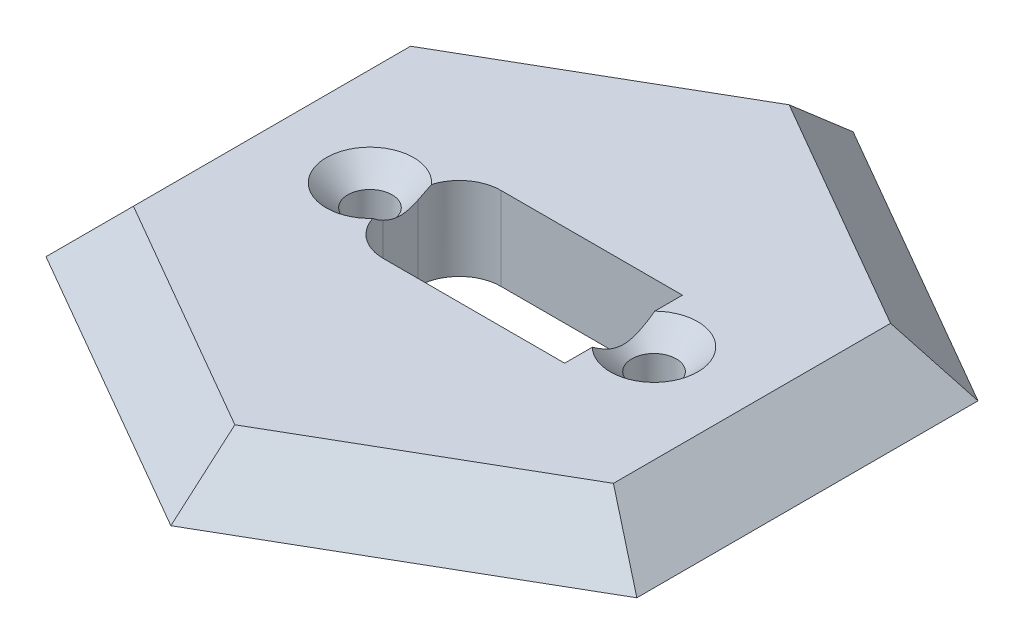
ISO-10303-21;
HEADER;
FILE_DESCRIPTION(('STEP AP214'),'2;1');
FILE_NAME('part.step','',(''),(''),'','','');
FILE_SCHEMA(('AUTOMOTIVE_DESIGN { 1 0 10303 214 1 1 1 1 }'));
ENDSEC;
DATA;
#1=APPLICATION_CONTEXT('core data for automotive mechanical design processes');
#2=APPLICATION_PROTOCOL_DEFINITION('international standard','automotive_design',2000,#1);
#3=PRODUCT_CONTEXT('',#1,'mechanical');
#4=PRODUCT('Part','Part','',(#3));
#5=PRODUCT_RELATED_PRODUCT_CATEGORY('part','',(#4));
#6=PRODUCT_DEFINITION_FORMATION('','',#4);
#7=PRODUCT_DEFINITION_CONTEXT('part definition',#1,'design');
#8=PRODUCT_DEFINITION('design','',#6,#7);
#9=PRODUCT_DEFINITION_SHAPE('','',#8);
#10=(LENGTH_UNIT() NAMED_UNIT(*) SI_UNIT(.MILLI.,.METRE.));
#11=(NAMED_UNIT(*) PLANE_ANGLE_UNIT() SI_UNIT($,.RADIAN.));
#12=(NAMED_UNIT(*) SI_UNIT($,.STERADIAN.) SOLID_ANGLE_UNIT());
#13=UNCERTAINTY_MEASURE_WITH_UNIT(LENGTH_MEASURE(1.E-05),#10,'distance_accuracy_value','');
#14=(GEOMETRIC_REPRESENTATION_CONTEXT(3) GLOBAL_UNCERTAINTY_ASSIGNED_CONTEXT((#13)) GLOBAL_UNIT_ASSIGNED_CONTEXT((#10,
#11,#12)) REPRESENTATION_CONTEXT('',''));
#15=CARTESIAN_POINT('',(0.,0.,0.));
#16=DIRECTION('',(0.,0.,1.));
#17=DIRECTION('',(1.,0.,0.));
#18=AXIS2_PLACEMENT_3D('',#15,#16,#17);
#19=CARTESIAN_POINT('',(0.,4.,0.));
#20=DIRECTION('',(0.,1.,0.));
#21=DIRECTION('',(0.,0.,1.));
#22=AXIS2_PLACEMENT_3D('',#19,#20,#21);
#23=PLANE('',#22);
#24=CARTESIAN_POINT('',(-10.25,4.,0.));
#25=DIRECTION('',(0.,1.,0.));
#26=DIRECTION('',(0.,0.,1.));
#27=AXIS2_PLACEMENT_3D('',#24,#25,#26);
#28=CIRCLE('',#27,3.15);
#29=CARTESIAN_POINT('',(-7.92085301054714,4.,-2.12074852387611));
#30=VERTEX_POINT('',#29);
#31=CARTESIAN_POINT('',(-7.92085301054721,4.,2.12074852387586));
#32=VERTEX_POINT('',#31);
#33=EDGE_CURVE('E70',#30,#32,#28,.T.);
#34=ORIENTED_EDGE('',*,*,#33,.F.);
#35=CARTESIAN_POINT('',(-5.05,4.,-1.25));
#36=DIRECTION('',(0.,1.,0.));
#37=DIRECTION('',(0.,0.,-1.));
#38=AXIS2_PLACEMENT_3D('',#35,#36,#37);
#39=CIRCLE('',#38,3.);
#40=CARTESIAN_POINT('',(-5.04999999999998,4.,-4.25));
#41=VERTEX_POINT('',#40);
#42=EDGE_CURVE('E168',#41,#30,#39,.T.);
#43=ORIENTED_EDGE('',*,*,#42,.F.);
#44=DIRECTION('',(-1.,0.,0.));
#45=VECTOR('',#44,1.);
#46=CARTESIAN_POINT('',(-5.04999999999998,4.,-4.25));
#47=LINE('',#46,#45);
#48=CARTESIAN_POINT('',(8.05,4.,-4.25));
#49=VERTEX_POINT('',#48);
#50=EDGE_CURVE('E179',#49,#41,#47,.T.);
#51=ORIENTED_EDGE('',*,*,#50,.F.);
#52=DIRECTION('',(0.,0.,-1.));
#53=VECTOR('',#52,1.);
#54=CARTESIAN_POINT('',(8.05,4.,4.25));
#55=LINE('',#54,#53);
#56=CARTESIAN_POINT('',(8.05,4.,-2.2544400635191));
#57=VERTEX_POINT('',#56);
#58=EDGE_CURVE('E248',#57,#49,#55,.T.);
#59=ORIENTED_EDGE('',*,*,#58,.F.);
#60=CARTESIAN_POINT('',(10.25,4.,0.));
#61=DIRECTION('',(0.,1.,0.));
#62=DIRECTION('',(0.,0.,1.));
#63=AXIS2_PLACEMENT_3D('',#60,#61,#62);
#64=CIRCLE('',#63,3.15);
#65=CARTESIAN_POINT('',(8.05,4.,2.2544400635191));
#66=VERTEX_POINT('',#65);
#67=EDGE_CURVE('E76',#66,#57,#64,.T.);
#68=ORIENTED_EDGE('',*,*,#67,.F.);
#69=CARTESIAN_POINT('',(8.05,4.,4.25));
#70=VERTEX_POINT('',#69);
#71=EDGE_CURVE('E185',#70,#66,#55,.T.);
#72=ORIENTED_EDGE('',*,*,#71,.F.);
#73=DIRECTION('',(1.,0.,0.));
#74=VECTOR('',#73,1.);
#75=CARTESIAN_POINT('',(-5.04999999999998,4.,4.25));
#76=LINE('',#75,#74);
#77=CARTESIAN_POINT('',(-5.04999999999998,4.,4.25));
#78=VERTEX_POINT('',#77);
#79=EDGE_CURVE('E183',#78,#70,#76,.T.);
#80=ORIENTED_EDGE('',*,*,#79,.F.);
#81=CARTESIAN_POINT('',(-5.05,4.,1.25));
#82=DIRECTION('',(0.,1.,0.));
#83=DIRECTION('',(0.,0.,-1.));
#84=AXIS2_PLACEMENT_3D('',#81,#82,#83);
#85=CIRCLE('',#84,3.);
#86=EDGE_CURVE('E170',#32,#78,#85,.T.);
#87=ORIENTED_EDGE('',*,*,#86,.F.);
#88=EDGE_LOOP('',(#34,#43,#51,#59,#68,#72,#80,#87));
#89=FACE_BOUND('',#88,.T.);
#90=DIRECTION('',(0.,0.,-1.));
#91=VECTOR('',#90,1.);
#92=CARTESIAN_POINT('',(17.3205080756888,4.,10.));
#93=LINE('',#92,#91);
#94=CARTESIAN_POINT('',(17.3205080756888,4.,10.));
#95=VERTEX_POINT('',#94);
#96=CARTESIAN_POINT('',(17.3205080756888,4.,-10.));
#97=VERTEX_POINT('',#96);
#98=EDGE_CURVE('E382',#95,#97,#93,.T.);
#99=ORIENTED_EDGE('',*,*,#98,.T.);
#100=DIRECTION('',(-0.866025403784439,0.,-0.5));
#101=VECTOR('',#100,1.);
#102=CARTESIAN_POINT('',(17.3205080756888,4.,-10.));
#103=LINE('',#102,#101);
#104=CARTESIAN_POINT('',(0.,4.,-20.));
#105=VERTEX_POINT('',#104);
#106=EDGE_CURVE('E314',#97,#105,#103,.T.);
#107=ORIENTED_EDGE('',*,*,#106,.T.);
#108=DIRECTION('',(-0.866025403784439,0.,0.5));
#109=VECTOR('',#108,1.);
#110=CARTESIAN_POINT('',(0.,4.,-20.));
#111=LINE('',#110,#109);
#112=CARTESIAN_POINT('',(-17.3205080756888,4.,-10.));
#113=VERTEX_POINT('',#112);
#114=EDGE_CURVE('E367',#105,#113,#111,.T.);
#115=ORIENTED_EDGE('',*,*,#114,.T.);
#116=DIRECTION('',(0.,0.,1.));
#117=VECTOR('',#116,1.);
#118=CARTESIAN_POINT('',(-17.3205080756888,4.,-10.));
#119=LINE('',#118,#117);
#120=CARTESIAN_POINT('',(-17.3205080756888,4.,9.99999999999999));
#121=VERTEX_POINT('',#120);
#122=EDGE_CURVE('E371',#113,#121,#119,.T.);
#123=ORIENTED_EDGE('',*,*,#122,.T.);
#124=DIRECTION('',(0.866025403784439,0.,0.5));
#125=VECTOR('',#124,1.);
#126=CARTESIAN_POINT('',(-17.3205080756888,4.,9.99999999999999));
#127=LINE('',#126,#125);
#128=CARTESIAN_POINT('',(0.,4.,20.));
#129=VERTEX_POINT('',#128);
#130=EDGE_CURVE('E375',#121,#129,#127,.T.);
#131=ORIENTED_EDGE('',*,*,#130,.T.);
#132=DIRECTION('',(0.866025403784439,0.,-0.5));
#133=VECTOR('',#132,1.);
#134=CARTESIAN_POINT('',(0.,4.,20.));
#135=LINE('',#134,#133);
#136=EDGE_CURVE('E379',#129,#95,#135,.T.);
#137=ORIENTED_EDGE('',*,*,#136,.T.);
#138=EDGE_LOOP('',(#99,#107,#115,#123,#131,#137));
#139=FACE_BOUND('',#138,.T.);
#140=ADVANCED_FACE('F48',(#89,#139),#23,.T.);
#141=CARTESIAN_POINT('',(0.,0.,0.));
#142=DIRECTION('',(0.,1.,0.));
#143=DIRECTION('',(0.,0.,1.));
#144=AXIS2_PLACEMENT_3D('',#141,#142,#143);
#145=PLANE('',#144);
#146=CARTESIAN_POINT('',(0.,0.,0.));
#147=DIRECTION('',(0.,-1.,0.));
#148=DIRECTION('',(0.,0.,-1.));
#149=AXIS2_PLACEMENT_3D('',#146,#147,#148);
#150=CIRCLE('',#149,17.);
#151=CARTESIAN_POINT('',(0.,0.,-17.));
#152=VERTEX_POINT('',#151);
#153=EDGE_CURVE('E216',#152,#152,#150,.T.);
#154=ORIENTED_EDGE('',*,*,#153,.F.);
#155=EDGE_LOOP('',(#154));
#156=FACE_BOUND('',#155,.T.);
#157=DIRECTION('',(0.866025403784439,0.,0.5));
#158=VECTOR('',#157,1.);
#159=CARTESIAN_POINT('',(10.6602540378444,0.,-18.4641016151378));
#160=LINE('',#159,#158);
#161=CARTESIAN_POINT('',(21.3205080756888,0.,-12.3094010767585));
#162=VERTEX_POINT('',#161);
#163=CARTESIAN_POINT('',(0.,0.,-24.618802153517));
#164=VERTEX_POINT('',#163);
#165=EDGE_CURVE('E263',#162,#164,#160,.F.);
#166=ORIENTED_EDGE('',*,*,#165,.F.);
#167=DIRECTION('',(0.,0.,1.));
#168=VECTOR('',#167,1.);
#169=CARTESIAN_POINT('',(21.3205080756888,0.,0.));
#170=LINE('',#169,#168);
#171=CARTESIAN_POINT('',(21.3205080756888,0.,12.3094010767585));
#172=VERTEX_POINT('',#171);
#173=EDGE_CURVE('E260',#172,#162,#170,.F.);
#174=ORIENTED_EDGE('',*,*,#173,.F.);
#175=DIRECTION('',(-0.866025403784439,0.,0.5));
#176=VECTOR('',#175,1.);
#177=CARTESIAN_POINT('',(10.6602540378444,0.,18.4641016151378));
#178=LINE('',#177,#176);
#179=CARTESIAN_POINT('',(0.,0.,24.618802153517));
#180=VERTEX_POINT('',#179);
#181=EDGE_CURVE('E257',#180,#172,#178,.F.);
#182=ORIENTED_EDGE('',*,*,#181,.F.);
#183=DIRECTION('',(-0.866025403784439,0.,-0.5));
#184=VECTOR('',#183,1.);
#185=CARTESIAN_POINT('',(-10.6602540378444,0.,18.4641016151378));
#186=LINE('',#185,#184);
#187=CARTESIAN_POINT('',(-21.3205080756888,0.,12.3094010767585));
#188=VERTEX_POINT('',#187);
#189=EDGE_CURVE('E254',#188,#180,#186,.F.);
#190=ORIENTED_EDGE('',*,*,#189,.F.);
#191=DIRECTION('',(0.,0.,-1.));
#192=VECTOR('',#191,1.);
#193=CARTESIAN_POINT('',(-21.3205080756888,0.,0.));
#194=LINE('',#193,#192);
#195=CARTESIAN_POINT('',(-21.3205080756888,0.,-12.3094010767585));
#196=VERTEX_POINT('',#195);
#197=EDGE_CURVE('E251',#196,#188,#194,.F.);
#198=ORIENTED_EDGE('',*,*,#197,.F.);
#199=DIRECTION('',(0.866025403784439,0.,-0.5));
#200=VECTOR('',#199,1.);
#201=CARTESIAN_POINT('',(-10.6602540378444,0.,-18.4641016151378));
#202=LINE('',#201,#200);
#203=EDGE_CURVE('E238',#164,#196,#202,.F.);
#204=ORIENTED_EDGE('',*,*,#203,.F.);
#205=EDGE_LOOP('',(#166,#174,#182,#190,#198,#204));
#206=FACE_BOUND('',#205,.T.);
#207=ADVANCED_FACE('F50',(#156,#206),#145,.F.);
#208=CARTESIAN_POINT('',(0.,-2.,0.));
#209=DIRECTION('',(0.,1.,0.));
#210=DIRECTION('',(0.,0.,1.));
#211=AXIS2_PLACEMENT_3D('',#208,#209,#210);
#212=CYLINDRICAL_SURFACE('',#211,17.);
#213=CARTESIAN_POINT('',(0.,-2.,0.));
#214=DIRECTION('',(0.,-1.,0.));
#215=DIRECTION('',(0.,0.,-1.));
#216=AXIS2_PLACEMENT_3D('',#213,#214,#215);
#217=CIRCLE('',#216,17.);
#218=CARTESIAN_POINT('',(0.,-2.,-17.));
#219=VERTEX_POINT('',#218);
#220=EDGE_CURVE('E196',#219,#219,#217,.T.);
#221=ORIENTED_EDGE('',*,*,#220,.F.);
#222=EDGE_LOOP('',(#221));
#223=FACE_BOUND('',#222,.T.);
#224=ORIENTED_EDGE('',*,*,#153,.T.);
#225=EDGE_LOOP('',(#224));
#226=FACE_BOUND('',#225,.T.);
#227=ADVANCED_FACE('F288',(#223,#226),#212,.T.);
#228=CARTESIAN_POINT('',(0.,-2.,0.));
#229=DIRECTION('',(0.,-1.,0.));
#230=DIRECTION('',(0.,0.,-1.));
#231=AXIS2_PLACEMENT_3D('',#228,#229,#230);
#232=PLANE('',#231);
#233=CARTESIAN_POINT('',(-10.25,-2.,0.));
#234=DIRECTION('',(0.,-1.,0.));
#235=DIRECTION('',(0.,0.,-1.));
#236=AXIS2_PLACEMENT_3D('',#233,#234,#235);
#237=CIRCLE('',#236,1.6);
#238=CARTESIAN_POINT('',(-10.25,-2.,-1.6));
#239=VERTEX_POINT('',#238);
#240=EDGE_CURVE('E243',#239,#239,#237,.T.);
#241=ORIENTED_EDGE('',*,*,#240,.F.);
#242=EDGE_LOOP('',(#241));
#243=FACE_BOUND('',#242,.T.);
#244=CARTESIAN_POINT('',(10.25,-2.,0.));
#245=DIRECTION('',(0.,-1.,0.));
#246=DIRECTION('',(0.,0.,-1.));
#247=AXIS2_PLACEMENT_3D('',#244,#245,#246);
#248=CIRCLE('',#247,1.6);
#249=CARTESIAN_POINT('',(10.25,-2.,-1.6));
#250=VERTEX_POINT('',#249);
#251=EDGE_CURVE('E239',#250,#250,#248,.T.);
#252=ORIENTED_EDGE('',*,*,#251,.F.);
#253=EDGE_LOOP('',(#252));
#254=FACE_BOUND('',#253,.T.);
#255=DIRECTION('',(0.,0.,1.));
#256=VECTOR('',#255,1.);
#257=CARTESIAN_POINT('',(8.05,-2.,0.));
#258=LINE('',#257,#256);
#259=CARTESIAN_POINT('',(8.05,-2.,-4.25));
#260=VERTEX_POINT('',#259);
#261=CARTESIAN_POINT('',(8.05,-2.,4.25));
#262=VERTEX_POINT('',#261);
#263=EDGE_CURVE('E235',#260,#262,#258,.T.);
#264=ORIENTED_EDGE('',*,*,#263,.F.);
#265=DIRECTION('',(1.,0.,0.));
#266=VECTOR('',#265,1.);
#267=CARTESIAN_POINT('',(0.,-2.,-4.25));
#268=LINE('',#267,#266);
#269=CARTESIAN_POINT('',(-5.04999999999998,-2.,-4.25));
#270=VERTEX_POINT('',#269);
#271=EDGE_CURVE('E220',#270,#260,#268,.T.);
#272=ORIENTED_EDGE('',*,*,#271,.F.);
#273=CARTESIAN_POINT('',(-5.05,-2.,-1.25));
#274=DIRECTION('',(0.,-1.,0.));
#275=DIRECTION('',(0.,0.,-1.));
#276=AXIS2_PLACEMENT_3D('',#273,#274,#275);
#277=CIRCLE('',#276,3.);
#278=CARTESIAN_POINT('',(-8.05,-2.,-1.24999999999998));
#279=VERTEX_POINT('',#278);
#280=EDGE_CURVE('E223',#279,#270,#277,.T.);
#281=ORIENTED_EDGE('',*,*,#280,.F.);
#282=DIRECTION('',(0.,0.,-1.));
#283=VECTOR('',#282,1.);
#284=CARTESIAN_POINT('',(-8.05,-2.,0.));
#285=LINE('',#284,#283);
#286=CARTESIAN_POINT('',(-8.05,-2.,1.24999999999998));
#287=VERTEX_POINT('',#286);
#288=EDGE_CURVE('E226',#287,#279,#285,.T.);
#289=ORIENTED_EDGE('',*,*,#288,.F.);
#290=CARTESIAN_POINT('',(-5.05,-2.,1.25));
#291=DIRECTION('',(0.,-1.,0.));
#292=DIRECTION('',(0.,0.,-1.));
#293=AXIS2_PLACEMENT_3D('',#290,#291,#292);
#294=CIRCLE('',#293,3.);
#295=CARTESIAN_POINT('',(-5.04999999999998,-2.,4.25));
#296=VERTEX_POINT('',#295);
#297=EDGE_CURVE('E229',#296,#287,#294,.T.);
#298=ORIENTED_EDGE('',*,*,#297,.F.);
#299=DIRECTION('',(-1.,0.,0.));
#300=VECTOR('',#299,1.);
#301=CARTESIAN_POINT('',(0.,-2.,4.25));
#302=LINE('',#301,#300);
#303=EDGE_CURVE('E232',#262,#296,#302,.T.);
#304=ORIENTED_EDGE('',*,*,#303,.F.);
#305=EDGE_LOOP('',(#264,#272,#281,#289,#298,#304));
#306=FACE_BOUND('',#305,.T.);
#307=ORIENTED_EDGE('',*,*,#220,.T.);
#308=EDGE_LOOP('',(#307));
#309=FACE_BOUND('',#308,.T.);
#310=ADVANCED_FACE('F282',(#243,#254,#306,#309),#232,.T.);
#311=CARTESIAN_POINT('',(8.05,-16.,4.25));
#312=DIRECTION('',(1.,0.,0.));
#313=DIRECTION('',(0.,0.,-1.));
#314=AXIS2_PLACEMENT_3D('',#311,#312,#313);
#315=PLANE('',#314);
#316=ORIENTED_EDGE('',*,*,#71,.T.);
#317=CARTESIAN_POINT('',(8.05,5.88776994401236,-4.53201125426609));
#318=CARTESIAN_POINT('',(8.05,5.79552288921214,-4.42945558697828));
#319=CARTESIAN_POINT('',(8.05,5.7035912538906,-4.32661378925197));
#320=CARTESIAN_POINT('',(8.05,5.52052544884391,-4.12020803771156));
#321=CARTESIAN_POINT('',(8.05,5.42939134573121,-4.01664402484963));
#322=CARTESIAN_POINT('',(8.05,5.24779769198032,-3.80831111917057));
#323=CARTESIAN_POINT('',(8.05,5.15734144093055,-3.70353934548399));
#324=CARTESIAN_POINT('',(8.05,4.977667481908,-3.49294420753631));
#325=CARTESIAN_POINT('',(8.05,4.88844972799008,-3.38712088253637));
#326=CARTESIAN_POINT('',(8.05,4.70654503975932,-3.16810255959324));
#327=CARTESIAN_POINT('',(8.05,4.61395000075133,-3.05483103536417));
#328=CARTESIAN_POINT('',(8.05,4.43107119404821,-2.82643892557324));
#329=CARTESIAN_POINT('',(8.05,4.3407873141612,-2.71131843021019));
#330=CARTESIAN_POINT('',(8.05,4.16346069699886,-2.47884447586285));
#331=CARTESIAN_POINT('',(8.05,4.07641372406316,-2.36149426212796));
#332=CARTESIAN_POINT('',(8.05,3.90666242735435,-2.12370873499496));
#333=CARTESIAN_POINT('',(8.05,3.82395693574178,-2.00327426435255));
#334=CARTESIAN_POINT('',(8.05,3.684110851468,-1.78805430944103));
#335=CARTESIAN_POINT('',(8.05,3.62563798539721,-1.69413938229576));
#336=CARTESIAN_POINT('',(8.05,3.51350091774603,-1.50339592287809));
#337=CARTESIAN_POINT('',(8.05,3.45983870161394,-1.40656620943964));
#338=CARTESIAN_POINT('',(8.05,3.35956324793287,-1.21035503809914));
#339=CARTESIAN_POINT('',(8.05,3.31289214812394,-1.1110035248744));
#340=CARTESIAN_POINT('',(8.05,3.22846193426358,-0.908577967255503));
#341=CARTESIAN_POINT('',(8.05,3.19069475417803,-0.805507390327418));
#342=CARTESIAN_POINT('',(8.05,3.13923314094333,-0.635915416750463));
#343=CARTESIAN_POINT('',(8.05,3.12185849586593,-0.570511687314567));
#344=CARTESIAN_POINT('',(8.05,3.09235773281676,-0.438521593061798));
#345=CARTESIAN_POINT('',(8.05,3.08023077099655,-0.371935420180614));
#346=CARTESIAN_POINT('',(8.05,3.0618680163744,-0.238180725747059));
#347=CARTESIAN_POINT('',(8.05,3.05561182152822,-0.171015045737476));
#348=CARTESIAN_POINT('',(8.05,3.04927368388518,-0.0363887051491592));
#349=CARTESIAN_POINT('',(8.05,3.04919164780455,0.0310719509574561));
#350=CARTESIAN_POINT('',(8.05,3.05520594092248,0.165697251868993));
#351=CARTESIAN_POINT('',(8.05,3.06130088003633,0.2328619598594));
#352=CARTESIAN_POINT('',(8.05,3.07932118025313,0.36640783283554));
#353=CARTESIAN_POINT('',(8.05,3.09124790919362,0.432788810255741));
#354=CARTESIAN_POINT('',(8.05,3.12039139975053,0.56465259400077));
#355=CARTESIAN_POINT('',(8.05,3.13762994183702,0.630130520665635));
#356=CARTESIAN_POINT('',(8.05,3.17665542817118,0.759700216233428));
#357=CARTESIAN_POINT('',(8.05,3.19844247913602,0.823791952574596));
#358=CARTESIAN_POINT('',(8.05,3.25128955009676,0.965101085266058));
#359=CARTESIAN_POINT('',(8.05,3.28332993896446,1.04194958331991));
#360=CARTESIAN_POINT('',(8.05,3.3520101657685,1.19357763697271));
#361=CARTESIAN_POINT('',(8.05,3.38865215426109,1.26835620511736));
#362=CARTESIAN_POINT('',(8.05,3.46562008410505,1.41614045481915));
#363=CARTESIAN_POINT('',(8.05,3.50595220820446,1.48914289158997));
#364=CARTESIAN_POINT('',(8.05,3.58949165241533,1.63348652183431));
#365=CARTESIAN_POINT('',(8.05,3.63269938434699,1.70482747538081));
#366=CARTESIAN_POINT('',(8.05,3.72202106739007,1.84705427350658));
#367=CARTESIAN_POINT('',(8.05,3.76816720492776,1.91791980984576));
#368=CARTESIAN_POINT('',(8.05,3.86234625857754,2.05838374263129));
#369=CARTESIAN_POINT('',(8.05,3.91037922816282,2.12798210308371));
#370=CARTESIAN_POINT('',(8.05,4.00791824871488,2.26601647590759));
#371=CARTESIAN_POINT('',(8.05,4.05742255227027,2.33445372650353));
#372=CARTESIAN_POINT('',(8.05,4.15768322731247,2.47039833393273));
#373=CARTESIAN_POINT('',(8.05,4.2084395518066,2.53790572551904));
#374=CARTESIAN_POINT('',(8.05,4.38109063880976,2.76390576343425));
#375=CARTESIAN_POINT('',(8.05,4.50535639768302,2.9205869321287));
#376=CARTESIAN_POINT('',(8.05,4.7577175404945,3.23084277102247));
#377=CARTESIAN_POINT('',(8.05,4.88581350373622,3.38441696535455));
#378=CARTESIAN_POINT('',(8.05,5.1447421119089,3.68934842952603));
#379=CARTESIAN_POINT('',(8.05,5.27557590285201,3.84070472401844));
#380=CARTESIAN_POINT('',(8.05,5.53919226790598,4.14171338125875));
#381=CARTESIAN_POINT('',(8.05,5.67197490073151,4.29136569242685));
#382=CARTESIAN_POINT('',(8.05,5.93927247155715,4.58967166168537));
#383=CARTESIAN_POINT('',(8.05,6.07379042419925,4.73832261442289));
#384=CARTESIAN_POINT('',(8.05,6.34395178402922,5.03459905936306));
#385=CARTESIAN_POINT('',(8.05,6.47959520057597,5.18222454301955));
#386=CARTESIAN_POINT('',(8.05,6.88775928063837,5.62381124079156));
#387=CARTESIAN_POINT('',(8.05,7.16158697719268,5.916563805233));
#388=CARTESIAN_POINT('',(8.05,7.67886598919352,6.46534491595376));
#389=CARTESIAN_POINT('',(8.05,7.9220671904053,6.72161004061001));
#390=CARTESIAN_POINT('',(8.05,8.40974815976266,7.23295983620239));
#391=CARTESIAN_POINT('',(8.05,8.65422802910063,7.48804441060532));
#392=CARTESIAN_POINT('',(8.05,9.14322866544042,7.9964030132443));
#393=CARTESIAN_POINT('',(8.05,9.38774609712871,8.24968025323676));
#394=CARTESIAN_POINT('',(8.05,9.87747173321314,8.75552122912428));
#395=CARTESIAN_POINT('',(8.05,10.1226798722246,9.00808502830404));
#396=CARTESIAN_POINT('',(8.05,10.3681418542701,9.26040087458473));
#397=B_SPLINE_CURVE_WITH_KNOTS('',3,(#317,#318,#319,#320,#321,#322,#323,#324,#325,#326,#327,
#328,#329,#330,#331,#332,#333,#334,#335,#336,#337,#338,#339,#340,#341,#342,#343,#344,#345,#346,
#347,#348,#349,#350,#351,#352,#353,#354,#355,#356,#357,#358,#359,#360,#361,#362,#363,#364,#365,
#366,#367,#368,#369,#370,#371,#372,#373,#374,#375,#376,#377,#378,#379,#380,#381,#382,#383,#384,
#385,#386,#387,#388,#389,#390,#391,#392,#393,#394,#395,#396),.UNSPECIFIED.,.F.,.F.,(4,2,2,2,2,2,
2,2,2,2,2,2,2,2,2,2,2,2,2,2,2,2,2,2,2,2,2,2,2,2,2,2,2,2,2,2,2,2,2,4),(0.,0.413819199168992,
0.827672638136937,1.24291798283643,1.65814788158306,2.09703163388058,2.53589404064617,
2.97416037162922,3.41230820032737,3.74409646098779,4.07602103264668,4.4050253830496,
4.73373053422526,4.93656732751132,5.13937149169901,5.34146823357136,5.54356192201519,
5.74561014079606,5.94770577243133,6.15064135621035,6.35358170180185,6.60316539244486,
6.85286616308926,7.10299324379599,7.35315622298819,7.60681677800365,7.86048452700389,
8.1138621852535,8.36723034779093,8.96705564571565,9.56697212840348,10.1671449591739,
10.7673359092095,11.3687681029784,11.9702053030288,13.1727519660781,14.2326382208286,
15.292609662823,16.3487536767008,17.4048008640878),.UNSPECIFIED.);
#398=EDGE_CURVE('E63',#66,#57,#397,.F.);
#399=ORIENTED_EDGE('',*,*,#398,.T.);
#400=ORIENTED_EDGE('',*,*,#58,.T.);
#401=DIRECTION('',(0.,1.,0.));
#402=VECTOR('',#401,1.);
#403=CARTESIAN_POINT('',(8.05,-16.,-4.25));
#404=LINE('',#403,#402);
#405=EDGE_CURVE('E192',#260,#49,#404,.T.);
#406=ORIENTED_EDGE('',*,*,#405,.F.);
#407=ORIENTED_EDGE('',*,*,#263,.T.);
#408=DIRECTION('',(0.,1.,0.));
#409=VECTOR('',#408,1.);
#410=CARTESIAN_POINT('',(8.05,-16.,4.25));
#411=LINE('',#410,#409);
#412=EDGE_CURVE('E193',#262,#70,#411,.T.);
#413=ORIENTED_EDGE('',*,*,#412,.T.);
#414=EDGE_LOOP('',(#316,#399,#400,#406,#407,#413));
#415=FACE_BOUND('',#414,.T.);
#416=ADVANCED_FACE('F276',(#415),#315,.F.);
#417=CARTESIAN_POINT('',(-5.04999999999998,-16.,4.25));
#418=DIRECTION('',(0.,0.,1.));
#419=DIRECTION('',(1.,0.,0.));
#420=AXIS2_PLACEMENT_3D('',#417,#418,#419);
#421=PLANE('',#420);
#422=ORIENTED_EDGE('',*,*,#303,.T.);
#423=DIRECTION('',(0.,1.,0.));
#424=VECTOR('',#423,1.);
#425=CARTESIAN_POINT('',(-5.04999999999998,-16.,4.25));
#426=LINE('',#425,#424);
#427=EDGE_CURVE('E197',#296,#78,#426,.T.);
#428=ORIENTED_EDGE('',*,*,#427,.T.);
#429=ORIENTED_EDGE('',*,*,#79,.T.);
#430=ORIENTED_EDGE('',*,*,#412,.F.);
#431=EDGE_LOOP('',(#422,#428,#429,#430));
#432=FACE_BOUND('',#431,.T.);
#433=ADVANCED_FACE('F281',(#432),#421,.F.);
#434=CARTESIAN_POINT('',(-5.05,-16.,1.25));
#435=DIRECTION('',(0.,1.,0.));
#436=DIRECTION('',(0.,0.,1.));
#437=AXIS2_PLACEMENT_3D('',#434,#435,#436);
#438=CYLINDRICAL_SURFACE('',#437,3.);
#439=DIRECTION('',(0.,1.,0.));
#440=VECTOR('',#439,1.);
#441=CARTESIAN_POINT('',(-8.05,-16.,1.24999999999998));
#442=LINE('',#441,#440);
#443=CARTESIAN_POINT('',(-8.05,3.380316185776,1.24999999999998));
#444=VERTEX_POINT('',#443);
#445=EDGE_CURVE('E201',#287,#444,#442,.T.);
#446=ORIENTED_EDGE('',*,*,#445,.T.);
#447=CARTESIAN_POINT('',(-8.04998760093809,3.37607718202849,1.24137479172843));
#448=CARTESIAN_POINT('',(-8.04999567772728,3.37745161358634,1.24418589152961));
#449=CARTESIAN_POINT('',(-8.04999980141325,3.37883170738633,1.24699429422211));
#450=CARTESIAN_POINT('',(-8.05000475054784,3.41456511140938,1.31934636616054));
#451=CARTESIAN_POINT('',(-8.04759375612452,3.45235018202452,1.38723569674285));
#452=CARTESIAN_POINT('',(-8.03858311246755,3.53279424863439,1.51981040458883));
#453=CARTESIAN_POINT('',(-8.0319768792092,3.57546081922704,1.58449057304288));
#454=CARTESIAN_POINT('',(-8.01504335373948,3.6643846718136,1.71109120403412));
#455=CARTESIAN_POINT('',(-8.00470515789291,3.7106521605924,1.7730029762068));
#456=CARTESIAN_POINT('',(-7.98068346023095,3.80566838519096,1.89413061398324));
#457=CARTESIAN_POINT('',(-7.96700211104617,3.85441550846356,1.95334818537338));
#458=CARTESIAN_POINT('',(-7.94206696052587,3.93576749448442,2.04838068502665));
#459=CARTESIAN_POINT('',(-7.93172700552225,3.96782845232808,2.0849078877546));
#460=CARTESIAN_POINT('',(-7.91251531939726,4.02466773059707,2.14822957847244));
#461=CARTESIAN_POINT('',(-7.90390151168934,4.04931289962244,2.17522287458028));
#462=CARTESIAN_POINT('',(-7.85915413886983,4.17332931563397,2.30896119680817));
#463=CARTESIAN_POINT('',(-7.81800626974395,4.27500961818055,2.41195132781633));
#464=CARTESIAN_POINT('',(-7.72592309491027,4.48115013891006,2.61067291310477));
#465=CARTESIAN_POINT('',(-7.67497560343856,4.58561367722245,2.7063951208841));
#466=CARTESIAN_POINT('',(-7.56389652292641,4.79598325336077,2.89069920571134));
#467=CARTESIAN_POINT('',(-7.50376429158811,4.901889391597,2.97928058273157));
#468=CARTESIAN_POINT('',(-7.40711653414247,5.06102268793247,3.10656412553554));
#469=CARTESIAN_POINT('',(-7.3738612003548,5.11406105629082,3.14802291713335));
#470=CARTESIAN_POINT('',(-7.30523502367783,5.22018942441799,3.22907364758905));
#471=CARTESIAN_POINT('',(-7.26986430500911,5.27327942097532,3.26866569582298));
#472=CARTESIAN_POINT('',(-7.23345730429755,5.32636156003217,3.30730751233505));
#473=B_SPLINE_CURVE_WITH_KNOTS('',3,(#447,#448,#449,#450,#451,#452,#453,#454,#455,#456,#457,
#458,#459,#460,#461,#462,#463,#464,#465,#466,#467,#468,#469,#470,#471,#472),.UNSPECIFIED.,.F.,
.F.,(4,2,2,2,2,2,2,2,2,2,2,2,4),(0.,0.00938752666886937,0.242080623787515,0.475139815951356,
0.708885520141946,0.942481112046757,1.09152259958736,1.20417420963375,1.65487712111016,
2.10614414475423,2.55744274040381,2.78265414970397,3.00785234699921),.UNSPECIFIED.);
#474=EDGE_CURVE('E12',#444,#32,#473,.T.);
#475=ORIENTED_EDGE('',*,*,#474,.T.);
#476=ORIENTED_EDGE('',*,*,#86,.T.);
#477=ORIENTED_EDGE('',*,*,#427,.F.);
#478=ORIENTED_EDGE('',*,*,#297,.T.);
#479=EDGE_LOOP('',(#446,#475,#476,#477,#478));
#480=FACE_BOUND('',#479,.T.);
#481=ADVANCED_FACE('F419',(#480),#438,.F.);
#482=CARTESIAN_POINT('',(-8.05,-16.,1.24999999999998));
#483=DIRECTION('',(-1.,0.,0.));
#484=DIRECTION('',(0.,0.,1.));
#485=AXIS2_PLACEMENT_3D('',#482,#483,#484);
#486=PLANE('',#485);
#487=DIRECTION('',(0.,1.,0.));
#488=VECTOR('',#487,1.);
#489=CARTESIAN_POINT('',(-8.05,-16.,-1.24999999999998));
#490=LINE('',#489,#488);
#491=CARTESIAN_POINT('',(-8.05,3.380316185776,-1.24999999999998));
#492=VERTEX_POINT('',#491);
#493=EDGE_CURVE('E205',#279,#492,#490,.T.);
#494=ORIENTED_EDGE('',*,*,#493,.T.);
#495=CARTESIAN_POINT('',(-8.05,4.04271554082538,-2.31374858716929));
#496=CARTESIAN_POINT('',(-8.05,4.00124865199346,-2.2565164769936));
#497=CARTESIAN_POINT('',(-8.05,3.96024685701552,-2.19894221273686));
#498=CARTESIAN_POINT('',(-8.05,3.87937022698615,-2.08298468402822));
#499=CARTESIAN_POINT('',(-8.05,3.83949570778256,-2.02460119954002));
#500=CARTESIAN_POINT('',(-8.05,3.76079589327907,-1.90648530150564));
#501=CARTESIAN_POINT('',(-8.05,3.72198086774058,-1.84674601041902));
#502=CARTESIAN_POINT('',(-8.05,3.64601220942833,-1.72622831422233));
#503=CARTESIAN_POINT('',(-8.05,3.60885845340811,-1.66544998666043));
#504=CARTESIAN_POINT('',(-8.05,3.49706072252303,-1.47572294552068));
#505=CARTESIAN_POINT('',(-8.05,3.42575399202773,-1.34476679392823));
#506=CARTESIAN_POINT('',(-8.05,3.29652736146864,-1.0766605669708));
#507=CARTESIAN_POINT('',(-8.05,3.23856376644298,-0.939532518935735));
#508=CARTESIAN_POINT('',(-8.05,3.16740702927521,-0.731052069509704));
#509=CARTESIAN_POINT('',(-8.05,3.14655514106996,-0.662319121160674));
#510=CARTESIAN_POINT('',(-8.05,3.11040374468697,-0.523376576891461));
#511=CARTESIAN_POINT('',(-8.05,3.09510466043713,-0.453166868661011));
#512=CARTESIAN_POINT('',(-8.05,3.07106256870315,-0.312764651579374));
#513=CARTESIAN_POINT('',(-8.05,3.06221936736127,-0.242589553338242));
#514=CARTESIAN_POINT('',(-8.05,3.05123112943656,-0.101714510847381));
#515=CARTESIAN_POINT('',(-8.05,3.04908529696909,-0.0310146299614014));
#516=CARTESIAN_POINT('',(-8.05,3.05159618903967,0.108478181380193));
#517=CARTESIAN_POINT('',(-8.05,3.05608290936891,0.177274283965098));
#518=CARTESIAN_POINT('',(-8.05,3.07127814062294,0.314178530256199));
#519=CARTESIAN_POINT('',(-8.05,3.0819879626484,0.382286525912806));
#520=CARTESIAN_POINT('',(-8.05,3.10926409169231,0.518461140538603));
#521=CARTESIAN_POINT('',(-8.05,3.12592313750604,0.586508938666373));
#522=CARTESIAN_POINT('',(-8.05,3.16427642537308,0.721134755583956));
#523=CARTESIAN_POINT('',(-8.05,3.18597002527901,0.787712960632458));
#524=CARTESIAN_POINT('',(-8.05,3.26560257578578,1.00793272992656));
#525=CARTESIAN_POINT('',(-8.05,3.33302953891531,1.15815913447272));
#526=CARTESIAN_POINT('',(-8.05,3.44511586331957,1.37789117279159));
#527=CARTESIAN_POINT('',(-8.05,3.48439409978072,1.45034329461979));
#528=CARTESIAN_POINT('',(-8.05,3.56588479631359,1.5935825034566));
#529=CARTESIAN_POINT('',(-8.05,3.60809669532049,1.66436990539691));
#530=CARTESIAN_POINT('',(-8.05,3.69262996510189,1.80090747594466));
#531=CARTESIAN_POINT('',(-8.05,3.73483551228303,1.8667302036948));
#532=CARTESIAN_POINT('',(-8.05,3.82096055117059,1.99725058523734));
#533=CARTESIAN_POINT('',(-8.05,3.86488017187027,2.06194815382376));
#534=CARTESIAN_POINT('',(-8.05,3.95374802137904,2.18982924490053));
#535=CARTESIAN_POINT('',(-8.05,3.99868459675615,2.25302089938225));
#536=CARTESIAN_POINT('',(-8.05,4.08970007346421,2.37855104860999));
#537=CARTESIAN_POINT('',(-8.05,4.1357786628417,2.4408897692777));
#538=CARTESIAN_POINT('',(-8.05,4.18232268506602,2.50287324437448));
#539=B_SPLINE_CURVE_WITH_KNOTS('',3,(#495,#496,#497,#498,#499,#500,#501,#502,#503,#504,#505,
#506,#507,#508,#509,#510,#511,#512,#513,#514,#515,#516,#517,#518,#519,#520,#521,#522,#523,#524,
#525,#526,#527,#528,#529,#530,#531,#532,#533,#534,#535,#536,#537,#538),.UNSPECIFIED.,.F.,.F.,(4,
2,2,2,2,2,2,2,2,2,2,2,2,2,2,2,2,2,2,2,2,4),(0.,0.212029895478164,0.424118621703257,
0.637818262161033,0.851502022248558,1.29839154326874,1.74379612250843,1.95908693234786,
2.17439417507254,2.38628441739433,2.59814947869171,2.80467736141511,3.01124877180154,
3.22119193175516,3.43110832857794,3.92353037676244,4.17075693186514,4.41793633416059,
4.65248456428478,4.88705047959129,5.11965745421895,5.35220157520174),.UNSPECIFIED.);
#540=EDGE_CURVE('E156',#492,#444,#539,.T.);
#541=ORIENTED_EDGE('',*,*,#540,.T.);
#542=ORIENTED_EDGE('',*,*,#445,.F.);
#543=ORIENTED_EDGE('',*,*,#288,.T.);
#544=EDGE_LOOP('',(#494,#541,#542,#543));
#545=FACE_BOUND('',#544,.T.);
#546=ADVANCED_FACE('F423',(#545),#486,.F.);
#547=CARTESIAN_POINT('',(-5.05,-16.,-1.25));
#548=DIRECTION('',(0.,1.,0.));
#549=DIRECTION('',(0.,0.,1.));
#550=AXIS2_PLACEMENT_3D('',#547,#548,#549);
#551=CYLINDRICAL_SURFACE('',#550,3.);
#552=ORIENTED_EDGE('',*,*,#42,.T.);
#553=CARTESIAN_POINT('',(-7.92078541667394,4.0002,-2.12097134936359));
#554=CARTESIAN_POINT('',(-7.93799044701553,3.94929636985869,-2.0642038221593));
#555=CARTESIAN_POINT('',(-7.95373266208577,3.89908376545359,-2.0063117381179));
#556=CARTESIAN_POINT('',(-7.98205771310487,3.80059328976358,-1.88780122126392));
#557=CARTESIAN_POINT('',(-7.99462897718136,3.75232303012561,-1.82717372804915));
#558=CARTESIAN_POINT('',(-8.01607583447376,3.65940318285674,-1.70412149078366));
#559=CARTESIAN_POINT('',(-8.02500782993097,3.61470771383358,-1.64174158081092));
#560=CARTESIAN_POINT('',(-8.03904808957873,3.52923361719577,-1.5140304819139));
#561=CARTESIAN_POINT('',(-8.04416281190948,3.48844847638772,-1.44870447677552));
#562=CARTESIAN_POINT('',(-8.04805561496799,3.43809048196796,-1.36013500487461));
#563=CARTESIAN_POINT('',(-8.04877933250792,3.42608171566532,-1.3383459246331));
#564=CARTESIAN_POINT('',(-8.04975280740862,3.40266917941796,-1.29436492657161));
#565=CARTESIAN_POINT('',(-8.05000137161168,3.39126700221931,-1.27217213554295));
#566=CARTESIAN_POINT('',(-8.04999999333361,3.38021739566596,-1.24980000000029));
#567=B_SPLINE_CURVE_WITH_KNOTS('',3,(#553,#554,#555,#556,#557,#558,#559,#560,#561,#562,#563,
#564,#565,#566),.UNSPECIFIED.,.F.,.F.,(4,2,2,2,2,2,4),(0.,0.234538480395636,0.469920875665378,
0.701502129643805,0.93269069604355,1.00734734181304,1.08219121290416),.UNSPECIFIED.);
#568=EDGE_CURVE('E153',#30,#492,#567,.T.);
#569=ORIENTED_EDGE('',*,*,#568,.T.);
#570=ORIENTED_EDGE('',*,*,#493,.F.);
#571=ORIENTED_EDGE('',*,*,#280,.T.);
#572=DIRECTION('',(0.,1.,0.));
#573=VECTOR('',#572,1.);
#574=CARTESIAN_POINT('',(-5.04999999999998,-16.,-4.25));
#575=LINE('',#574,#573);
#576=EDGE_CURVE('E176',#270,#41,#575,.T.);
#577=ORIENTED_EDGE('',*,*,#576,.T.);
#578=EDGE_LOOP('',(#552,#569,#570,#571,#577));
#579=FACE_BOUND('',#578,.T.);
#580=ADVANCED_FACE('F174',(#579),#551,.F.);
#581=CARTESIAN_POINT('',(-5.04999999999998,-16.,-4.25));
#582=DIRECTION('',(0.,0.,-1.));
#583=DIRECTION('',(-1.,0.,0.));
#584=AXIS2_PLACEMENT_3D('',#581,#582,#583);
#585=PLANE('',#584);
#586=ORIENTED_EDGE('',*,*,#271,.T.);
#587=ORIENTED_EDGE('',*,*,#405,.T.);
#588=ORIENTED_EDGE('',*,*,#50,.T.);
#589=ORIENTED_EDGE('',*,*,#576,.F.);
#590=EDGE_LOOP('',(#586,#587,#588,#589));
#591=FACE_BOUND('',#590,.T.);
#592=ADVANCED_FACE('F284',(#591),#585,.F.);
#593=CARTESIAN_POINT('',(10.25,-6.,0.));
#594=DIRECTION('',(0.,1.,0.));
#595=DIRECTION('',(0.,0.,1.));
#596=AXIS2_PLACEMENT_3D('',#593,#594,#595);
#597=CYLINDRICAL_SURFACE('',#596,1.6);
#598=CARTESIAN_POINT('',(10.25,2.45,0.));
#599=DIRECTION('',(0.,1.,0.));
#600=DIRECTION('',(0.,0.,1.));
#601=AXIS2_PLACEMENT_3D('',#598,#599,#600);
#602=CIRCLE('',#601,1.59999999999999);
#603=CARTESIAN_POINT('',(10.25,2.45,1.59999999999999));
#604=VERTEX_POINT('',#603);
#605=EDGE_CURVE('E354',#604,#604,#602,.T.);
#606=ORIENTED_EDGE('',*,*,#605,.T.);
#607=EDGE_LOOP('',(#606));
#608=FACE_BOUND('',#607,.T.);
#609=ORIENTED_EDGE('',*,*,#251,.T.);
#610=EDGE_LOOP('',(#609));
#611=FACE_BOUND('',#610,.T.);
#612=ADVANCED_FACE('F413',(#608,#611),#597,.F.);
#613=CARTESIAN_POINT('',(-10.25,-6.,0.));
#614=DIRECTION('',(0.,1.,0.));
#615=DIRECTION('',(0.,0.,1.));
#616=AXIS2_PLACEMENT_3D('',#613,#614,#615);
#617=CYLINDRICAL_SURFACE('',#616,1.6);
#618=CARTESIAN_POINT('',(-10.25,2.45,0.));
#619=DIRECTION('',(0.,1.,0.));
#620=DIRECTION('',(0.,0.,1.));
#621=AXIS2_PLACEMENT_3D('',#618,#619,#620);
#622=CIRCLE('',#621,1.59999999999999);
#623=CARTESIAN_POINT('',(-10.25,2.45,1.59999999999999));
#624=VERTEX_POINT('',#623);
#625=EDGE_CURVE('E172',#624,#624,#622,.T.);
#626=ORIENTED_EDGE('',*,*,#625,.T.);
#627=EDGE_LOOP('',(#626));
#628=FACE_BOUND('',#627,.T.);
#629=ORIENTED_EDGE('',*,*,#240,.T.);
#630=EDGE_LOOP('',(#629));
#631=FACE_BOUND('',#630,.T.);
#632=ADVANCED_FACE('F410',(#628,#631),#617,.F.);
#633=CARTESIAN_POINT('',(17.3205080756888,4.,-10.));
#634=DIRECTION('',(-0.353553390593273,-0.707106781186549,0.612372435695794));
#635=DIRECTION('',(0.,-0.654653670707976,-0.755928946018456));
#636=AXIS2_PLACEMENT_3D('',#633,#634,#635);
#637=PLANE('',#636);
#638=ORIENTED_EDGE('',*,*,#165,.T.);
#639=DIRECTION('',(0.,0.654653670707976,0.755928946018456));
#640=VECTOR('',#639,1.);
#641=CARTESIAN_POINT('',(0.,8.94871659305393,-14.2857142857143));
#642=LINE('',#641,#640);
#643=EDGE_CURVE('E311',#164,#105,#642,.T.);
#644=ORIENTED_EDGE('',*,*,#643,.T.);
#645=ORIENTED_EDGE('',*,*,#106,.F.);
#646=DIRECTION('',(-0.654653670707978,0.654653670707976,0.377964473009228));
#647=VECTOR('',#646,1.);
#648=CARTESIAN_POINT('',(12.3717914826348,8.94871659305394,-7.14285714285714));
#649=LINE('',#648,#647);
#650=EDGE_CURVE('E244',#162,#97,#649,.T.);
#651=ORIENTED_EDGE('',*,*,#650,.F.);
#652=EDGE_LOOP('',(#638,#644,#645,#651));
#653=FACE_BOUND('',#652,.T.);
#654=ADVANCED_FACE('F309',(#653),#637,.F.);
#655=CARTESIAN_POINT('',(17.3205080756888,4.,10.));
#656=DIRECTION('',(-0.707106781186546,-0.707106781186549,0.));
#657=DIRECTION('',(0.707106781186549,-0.707106781186546,0.));
#658=AXIS2_PLACEMENT_3D('',#655,#656,#657);
#659=PLANE('',#658);
#660=ORIENTED_EDGE('',*,*,#173,.T.);
#661=ORIENTED_EDGE('',*,*,#650,.T.);
#662=ORIENTED_EDGE('',*,*,#98,.F.);
#663=DIRECTION('',(-0.654653670707978,0.654653670707976,-0.377964473009228));
#664=VECTOR('',#663,1.);
#665=CARTESIAN_POINT('',(12.3717914826348,8.94871659305393,7.14285714285714));
#666=LINE('',#665,#664);
#667=EDGE_CURVE('E319',#172,#95,#666,.T.);
#668=ORIENTED_EDGE('',*,*,#667,.F.);
#669=EDGE_LOOP('',(#660,#661,#662,#668));
#670=FACE_BOUND('',#669,.T.);
#671=ADVANCED_FACE('F387',(#670),#659,.F.);
#672=CARTESIAN_POINT('',(0.,4.,20.));
#673=DIRECTION('',(-0.353553390593273,-0.707106781186549,-0.612372435695794));
#674=DIRECTION('',(0.,0.654653670707976,-0.755928946018456));
#675=AXIS2_PLACEMENT_3D('',#672,#673,#674);
#676=PLANE('',#675);
#677=ORIENTED_EDGE('',*,*,#181,.T.);
#678=ORIENTED_EDGE('',*,*,#667,.T.);
#679=ORIENTED_EDGE('',*,*,#136,.F.);
#680=DIRECTION('',(0.,0.654653670707976,-0.755928946018456));
#681=VECTOR('',#680,1.);
#682=CARTESIAN_POINT('',(0.,8.94871659305393,14.2857142857143));
#683=LINE('',#682,#681);
#684=EDGE_CURVE('E322',#180,#129,#683,.T.);
#685=ORIENTED_EDGE('',*,*,#684,.F.);
#686=EDGE_LOOP('',(#677,#678,#679,#685));
#687=FACE_BOUND('',#686,.T.);
#688=ADVANCED_FACE('F389',(#687),#676,.F.);
#689=CARTESIAN_POINT('',(-17.3205080756888,4.,9.99999999999999));
#690=DIRECTION('',(0.353553390593273,-0.707106781186549,-0.612372435695793));
#691=DIRECTION('',(0.,0.654653670707976,-0.755928946018456));
#692=AXIS2_PLACEMENT_3D('',#689,#690,#691);
#693=PLANE('',#692);
#694=ORIENTED_EDGE('',*,*,#189,.T.);
#695=ORIENTED_EDGE('',*,*,#684,.T.);
#696=ORIENTED_EDGE('',*,*,#130,.F.);
#697=DIRECTION('',(0.654653670707978,0.654653670707976,-0.377964473009228));
#698=VECTOR('',#697,1.);
#699=CARTESIAN_POINT('',(-12.3717914826348,8.94871659305393,7.14285714285713));
#700=LINE('',#699,#698);
#701=EDGE_CURVE('E329',#188,#121,#700,.T.);
#702=ORIENTED_EDGE('',*,*,#701,.F.);
#703=EDGE_LOOP('',(#694,#695,#696,#702));
#704=FACE_BOUND('',#703,.T.);
#705=ADVANCED_FACE('F394',(#704),#693,.F.);
#706=CARTESIAN_POINT('',(-17.3205080756888,4.,-10.));
#707=DIRECTION('',(0.707106781186546,-0.707106781186549,0.));
#708=DIRECTION('',(0.707106781186549,0.707106781186546,0.));
#709=AXIS2_PLACEMENT_3D('',#706,#707,#708);
#710=PLANE('',#709);
#711=ORIENTED_EDGE('',*,*,#197,.T.);
#712=ORIENTED_EDGE('',*,*,#701,.T.);
#713=ORIENTED_EDGE('',*,*,#122,.F.);
#714=DIRECTION('',(0.654653670707978,0.654653670707976,0.377964473009228));
#715=VECTOR('',#714,1.);
#716=CARTESIAN_POINT('',(-12.3717914826348,8.94871659305393,-7.14285714285714));
#717=LINE('',#716,#715);
#718=EDGE_CURVE('E332',#196,#113,#717,.T.);
#719=ORIENTED_EDGE('',*,*,#718,.F.);
#720=EDGE_LOOP('',(#711,#712,#713,#719));
#721=FACE_BOUND('',#720,.T.);
#722=ADVANCED_FACE('F397',(#721),#710,.F.);
#723=CARTESIAN_POINT('',(0.,4.,-20.));
#724=DIRECTION('',(0.353553390593273,-0.707106781186549,0.612372435695793));
#725=DIRECTION('',(0.,-0.654653670707976,-0.755928946018456));
#726=AXIS2_PLACEMENT_3D('',#723,#724,#725);
#727=PLANE('',#726);
#728=ORIENTED_EDGE('',*,*,#203,.T.);
#729=ORIENTED_EDGE('',*,*,#718,.T.);
#730=ORIENTED_EDGE('',*,*,#114,.F.);
#731=ORIENTED_EDGE('',*,*,#643,.F.);
#732=EDGE_LOOP('',(#728,#729,#730,#731));
#733=FACE_BOUND('',#732,.T.);
#734=ADVANCED_FACE('F400',(#733),#727,.F.);
#735=CARTESIAN_POINT('',(10.25,4.,0.));
#736=DIRECTION('',(0.,1.,0.));
#737=DIRECTION('',(0.,0.,1.));
#738=AXIS2_PLACEMENT_3D('',#735,#736,#737);
#739=CONICAL_SURFACE('',#738,3.15,0.785398163397453);
#740=ORIENTED_EDGE('',*,*,#605,.F.);
#741=EDGE_LOOP('',(#740));
#742=FACE_BOUND('',#741,.T.);
#743=ORIENTED_EDGE('',*,*,#67,.T.);
#744=ORIENTED_EDGE('',*,*,#398,.F.);
#745=EDGE_LOOP('',(#743,#744));
#746=FACE_BOUND('',#745,.T.);
#747=ADVANCED_FACE('F273',(#742,#746),#739,.F.);
#748=CARTESIAN_POINT('',(-10.25,4.,0.));
#749=DIRECTION('',(0.,1.,0.));
#750=DIRECTION('',(0.,0.,1.));
#751=AXIS2_PLACEMENT_3D('',#748,#749,#750);
#752=CONICAL_SURFACE('',#751,3.15,0.785398163397453);
#753=ORIENTED_EDGE('',*,*,#625,.F.);
#754=EDGE_LOOP('',(#753));
#755=FACE_BOUND('',#754,.T.);
#756=ORIENTED_EDGE('',*,*,#33,.T.);
#757=ORIENTED_EDGE('',*,*,#474,.F.);
#758=ORIENTED_EDGE('',*,*,#540,.F.);
#759=ORIENTED_EDGE('',*,*,#568,.F.);
#760=EDGE_LOOP('',(#756,#757,#758,#759));
#761=FACE_BOUND('',#760,.T.);
#762=ADVANCED_FACE('F154',(#755,#761),#752,.F.);
#763=CLOSED_SHELL('',(#140,#207,#227,#310,#416,#433,#481,#546,#580,#592,#612,#632,#654,#671,
#688,#705,#722,#734,#747,#762));
#764=MANIFOLD_SOLID_BREP('B2',#763);
#765=ADVANCED_BREP_SHAPE_REPRESENTATION('',(#18,#764),#14);
#766=SHAPE_DEFINITION_REPRESENTATION(#9,#765);
ENDSEC;
END-ISO-10303-21;
